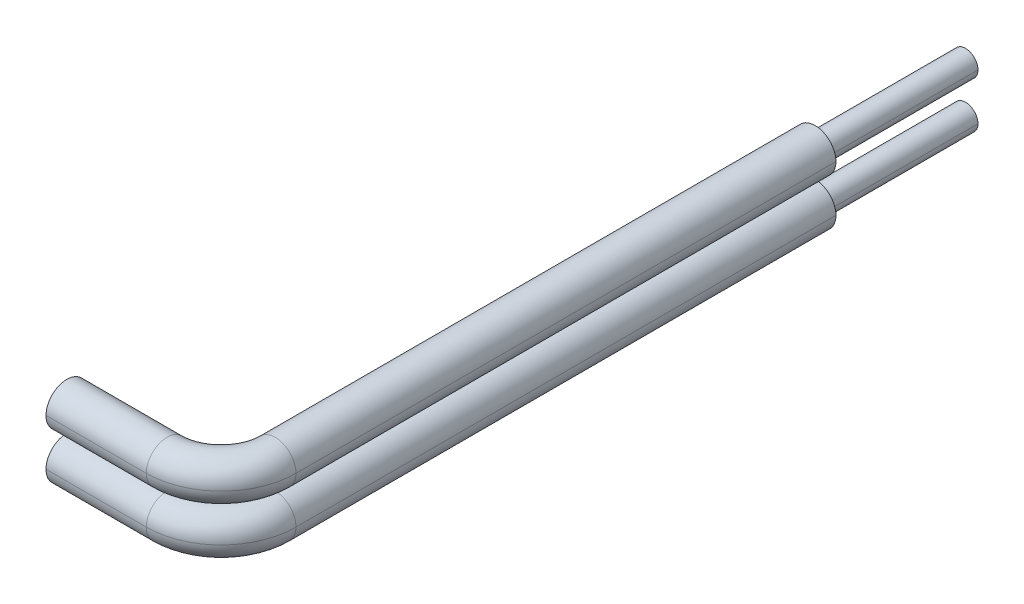
ISO-10303-21;
HEADER;
FILE_DESCRIPTION(('STEP AP214'),'2;1');
FILE_NAME('part.step','',(''),(''),'','','');
FILE_SCHEMA(('AUTOMOTIVE_DESIGN { 1 0 10303 214 1 1 1 1 }'));
ENDSEC;
DATA;
#1=APPLICATION_CONTEXT('core data for automotive mechanical design processes');
#2=APPLICATION_PROTOCOL_DEFINITION('international standard','automotive_design',2000,#1);
#3=PRODUCT_CONTEXT('',#1,'mechanical');
#4=PRODUCT('Part','Part','',(#3));
#5=PRODUCT_RELATED_PRODUCT_CATEGORY('part','',(#4));
#6=PRODUCT_DEFINITION_FORMATION('','',#4);
#7=PRODUCT_DEFINITION_CONTEXT('part definition',#1,'design');
#8=PRODUCT_DEFINITION('design','',#6,#7);
#9=PRODUCT_DEFINITION_SHAPE('','',#8);
#10=(LENGTH_UNIT() NAMED_UNIT(*) SI_UNIT(.MILLI.,.METRE.));
#11=(NAMED_UNIT(*) PLANE_ANGLE_UNIT() SI_UNIT($,.RADIAN.));
#12=(NAMED_UNIT(*) SI_UNIT($,.STERADIAN.) SOLID_ANGLE_UNIT());
#13=UNCERTAINTY_MEASURE_WITH_UNIT(LENGTH_MEASURE(1.E-05),#10,'distance_accuracy_value','');
#14=(GEOMETRIC_REPRESENTATION_CONTEXT(3) GLOBAL_UNCERTAINTY_ASSIGNED_CONTEXT((#13)) GLOBAL_UNIT_ASSIGNED_CONTEXT((#10,
#11,#12)) REPRESENTATION_CONTEXT('',''));
#15=CARTESIAN_POINT('',(0.,0.,0.));
#16=DIRECTION('',(0.,0.,1.));
#17=DIRECTION('',(1.,0.,0.));
#18=AXIS2_PLACEMENT_3D('',#15,#16,#17);
#19=CARTESIAN_POINT('',(154.1546666667,-0.93,-42.5));
#20=DIRECTION('',(0.,0.,-1.));
#21=DIRECTION('',(0.,-1.,0.));
#22=AXIS2_PLACEMENT_3D('',#19,#20,#21);
#23=PLANE('',#22);
#24=CARTESIAN_POINT('',(154.1546666667,-0.93,-42.5));
#25=DIRECTION('',(0.,0.,-1.));
#26=DIRECTION('',(1.,0.,0.));
#27=AXIS2_PLACEMENT_3D('',#24,#25,#26);
#28=CIRCLE('',#27,0.498);
#29=CARTESIAN_POINT('',(154.6526666667,-0.93,-42.5));
#30=VERTEX_POINT('',#29);
#31=CARTESIAN_POINT('',(153.6566666667,-0.93,-42.5));
#32=VERTEX_POINT('',#31);
#33=EDGE_CURVE('P0_E133',#30,#32,#28,.T.);
#34=ORIENTED_EDGE('',*,*,#33,.T.);
#35=CARTESIAN_POINT('',(154.1546666667,-0.93,-42.5));
#36=DIRECTION('',(0.,0.,-1.));
#37=DIRECTION('',(1.,0.,0.));
#38=AXIS2_PLACEMENT_3D('',#35,#36,#37);
#39=CIRCLE('',#38,0.498);
#40=EDGE_CURVE('P0_E11',#32,#30,#39,.T.);
#41=ORIENTED_EDGE('',*,*,#40,.T.);
#42=EDGE_LOOP('',(#34,#41));
#43=FACE_BOUND('',#42,.T.);
#44=ADVANCED_FACE('P0_F17',(#43),#23,.T.);
#45=CARTESIAN_POINT('',(154.1546666667,-0.93,-39.5));
#46=DIRECTION('',(0.,0.,-1.));
#47=DIRECTION('',(1.,0.,0.));
#48=AXIS2_PLACEMENT_3D('',#45,#46,#47);
#49=CYLINDRICAL_SURFACE('',#48,0.498);
#50=DIRECTION('',(0.,0.,-1.));
#51=VECTOR('',#50,1.);
#52=CARTESIAN_POINT('',(154.6526666667,-0.93,-39.5));
#53=LINE('',#52,#51);
#54=CARTESIAN_POINT('',(154.6526666667,-0.93,-36.5));
#55=VERTEX_POINT('',#54);
#56=EDGE_CURVE('P0_E147',#55,#30,#53,.T.);
#57=ORIENTED_EDGE('',*,*,#56,.T.);
#58=ORIENTED_EDGE('',*,*,#40,.F.);
#59=DIRECTION('',(0.,0.,1.));
#60=VECTOR('',#59,1.);
#61=CARTESIAN_POINT('',(153.6566666667,-0.93,-39.5));
#62=LINE('',#61,#60);
#63=CARTESIAN_POINT('',(153.6566666667,-0.93,-36.5));
#64=VERTEX_POINT('',#63);
#65=EDGE_CURVE('P0_E131',#32,#64,#62,.T.);
#66=ORIENTED_EDGE('',*,*,#65,.T.);
#67=CARTESIAN_POINT('',(154.1546666667,-0.93,-36.5));
#68=DIRECTION('',(0.,0.,1.));
#69=DIRECTION('',(1.,0.,0.));
#70=AXIS2_PLACEMENT_3D('',#67,#68,#69);
#71=CIRCLE('',#70,0.498);
#72=EDGE_CURVE('P0_E99',#55,#64,#71,.T.);
#73=ORIENTED_EDGE('',*,*,#72,.F.);
#74=EDGE_LOOP('',(#57,#58,#66,#73));
#75=FACE_BOUND('',#74,.T.);
#76=ADVANCED_FACE('P0_F251',(#75),#49,.T.);
#77=CARTESIAN_POINT('',(147.9966666667,-0.93,-12.8));
#78=DIRECTION('',(-1.,0.,0.));
#79=DIRECTION('',(0.,0.,1.));
#80=AXIS2_PLACEMENT_3D('',#77,#78,#79);
#81=PLANE('',#80);
#82=CARTESIAN_POINT('',(147.9966666667,-0.93,-12.8));
#83=DIRECTION('',(-1.,0.,0.));
#84=DIRECTION('',(0.,0.,-1.));
#85=AXIS2_PLACEMENT_3D('',#82,#83,#84);
#86=CIRCLE('',#85,0.83);
#87=CARTESIAN_POINT('',(147.9966666667,-0.93,-13.63));
#88=VERTEX_POINT('',#87);
#89=CARTESIAN_POINT('',(147.9966666667,-0.93,-11.97));
#90=VERTEX_POINT('',#89);
#91=EDGE_CURVE('P0_E116',#88,#90,#86,.T.);
#92=ORIENTED_EDGE('',*,*,#91,.T.);
#93=CARTESIAN_POINT('',(147.9966666667,-0.93,-12.8));
#94=DIRECTION('',(-1.,0.,0.));
#95=DIRECTION('',(0.,0.,-1.));
#96=AXIS2_PLACEMENT_3D('',#93,#94,#95);
#97=CIRCLE('',#96,0.83);
#98=EDGE_CURVE('P0_E28',#90,#88,#97,.T.);
#99=ORIENTED_EDGE('',*,*,#98,.T.);
#100=EDGE_LOOP('',(#92,#99));
#101=FACE_BOUND('',#100,.T.);
#102=ADVANCED_FACE('P0_F249',(#101),#81,.T.);
#103=CARTESIAN_POINT('',(149.9966666667,-0.93,-12.8));
#104=DIRECTION('',(-1.,0.,0.));
#105=DIRECTION('',(0.,0.,-1.));
#106=AXIS2_PLACEMENT_3D('',#103,#104,#105);
#107=CYLINDRICAL_SURFACE('',#106,0.83);
#108=DIRECTION('',(-1.,0.,0.));
#109=VECTOR('',#108,1.);
#110=CARTESIAN_POINT('',(149.9966666667,-0.93,-13.63));
#111=LINE('',#110,#109);
#112=CARTESIAN_POINT('',(151.9966666667,-0.93,-13.63));
#113=VERTEX_POINT('',#112);
#114=EDGE_CURVE('P0_E150',#113,#88,#111,.T.);
#115=ORIENTED_EDGE('',*,*,#114,.T.);
#116=ORIENTED_EDGE('',*,*,#98,.F.);
#117=DIRECTION('',(1.,0.,0.));
#118=VECTOR('',#117,1.);
#119=CARTESIAN_POINT('',(149.9966666667,-0.93,-11.97));
#120=LINE('',#119,#118);
#121=CARTESIAN_POINT('',(151.9966666667,-0.93,-11.97));
#122=VERTEX_POINT('',#121);
#123=EDGE_CURVE('P0_E125',#90,#122,#120,.T.);
#124=ORIENTED_EDGE('',*,*,#123,.T.);
#125=CARTESIAN_POINT('',(151.9966666667,-0.93,-12.8));
#126=DIRECTION('',(1.,0.,0.));
#127=DIRECTION('',(0.,0.,-1.));
#128=AXIS2_PLACEMENT_3D('',#125,#126,#127);
#129=CIRCLE('',#128,0.83);
#130=EDGE_CURVE('P0_E129',#113,#122,#129,.T.);
#131=ORIENTED_EDGE('',*,*,#130,.F.);
#132=EDGE_LOOP('',(#115,#116,#124,#131));
#133=FACE_BOUND('',#132,.T.);
#134=ADVANCED_FACE('P0_F244',(#133),#107,.T.);
#135=CARTESIAN_POINT('',(151.9966666667,-0.93,-14.958));
#136=DIRECTION('',(0.,-1.,0.));
#137=DIRECTION('',(0.,0.,-1.));
#138=AXIS2_PLACEMENT_3D('',#135,#136,#137);
#139=TOROIDAL_SURFACE('',#138,2.158,0.83);
#140=CARTESIAN_POINT('',(151.9966666667,-0.93,-14.958));
#141=DIRECTION('',(0.,-1.,0.));
#142=DIRECTION('',(0.,0.,-1.));
#143=AXIS2_PLACEMENT_3D('',#140,#141,#142);
#144=CIRCLE('',#143,2.988);
#145=CARTESIAN_POINT('',(154.9846666667,-0.93,-14.958));
#146=VERTEX_POINT('',#145);
#147=EDGE_CURVE('P0_E138',#146,#122,#144,.T.);
#148=ORIENTED_EDGE('',*,*,#147,.T.);
#149=CARTESIAN_POINT('',(151.9966666667,-0.93,-12.8));
#150=DIRECTION('',(1.,0.,0.));
#151=DIRECTION('',(0.,0.,-1.));
#152=AXIS2_PLACEMENT_3D('',#149,#150,#151);
#153=CIRCLE('',#152,0.83);
#154=EDGE_CURVE('P0_E153',#122,#113,#153,.T.);
#155=ORIENTED_EDGE('',*,*,#154,.T.);
#156=CARTESIAN_POINT('',(151.9966666667,-0.93,-14.958));
#157=DIRECTION('',(0.,1.,0.));
#158=DIRECTION('',(0.,0.,-1.));
#159=AXIS2_PLACEMENT_3D('',#156,#157,#158);
#160=CIRCLE('',#159,1.328);
#161=CARTESIAN_POINT('',(153.3246666667,-0.93,-14.958));
#162=VERTEX_POINT('',#161);
#163=EDGE_CURVE('P0_E21',#113,#162,#160,.T.);
#164=ORIENTED_EDGE('',*,*,#163,.T.);
#165=CARTESIAN_POINT('',(154.1546666667,-0.93,-14.958));
#166=DIRECTION('',(0.,0.,1.));
#167=DIRECTION('',(0.,-1.,0.));
#168=AXIS2_PLACEMENT_3D('',#165,#166,#167);
#169=CIRCLE('',#168,0.83);
#170=CARTESIAN_POINT('',(154.1546666667,-1.76,-14.958));
#171=VERTEX_POINT('',#170);
#172=EDGE_CURVE('P0_E123',#162,#171,#169,.T.);
#173=ORIENTED_EDGE('',*,*,#172,.T.);
#174=CARTESIAN_POINT('',(154.1546666667,-0.93,-14.958));
#175=DIRECTION('',(0.,0.,1.));
#176=DIRECTION('',(0.,-1.,0.));
#177=AXIS2_PLACEMENT_3D('',#174,#175,#176);
#178=CIRCLE('',#177,0.83);
#179=EDGE_CURVE('P0_E115',#171,#146,#178,.T.);
#180=ORIENTED_EDGE('',*,*,#179,.T.);
#181=EDGE_LOOP('',(#148,#155,#164,#173,#180));
#182=FACE_BOUND('',#181,.T.);
#183=ADVANCED_FACE('P0_F166',(#182),#139,.T.);
#184=CARTESIAN_POINT('',(154.1546666667,-0.93,-19.729));
#185=DIRECTION('',(0.,0.,-1.));
#186=DIRECTION('',(1.,0.,0.));
#187=AXIS2_PLACEMENT_3D('',#184,#185,#186);
#188=CYLINDRICAL_SURFACE('',#187,0.83);
#189=DIRECTION('',(0.,0.,-1.));
#190=VECTOR('',#189,1.);
#191=CARTESIAN_POINT('',(154.9846666667,-0.93,-19.729));
#192=LINE('',#191,#190);
#193=CARTESIAN_POINT('',(154.9846666667,-0.93,-36.5));
#194=VERTEX_POINT('',#193);
#195=EDGE_CURVE('P0_E105',#146,#194,#192,.T.);
#196=ORIENTED_EDGE('',*,*,#195,.T.);
#197=CARTESIAN_POINT('',(154.1546666667,-0.93,-36.5));
#198=DIRECTION('',(0.,0.,-1.));
#199=DIRECTION('',(1.,0.,0.));
#200=AXIS2_PLACEMENT_3D('',#197,#198,#199);
#201=CIRCLE('',#200,0.83);
#202=CARTESIAN_POINT('',(153.3246666667,-0.93,-36.5));
#203=VERTEX_POINT('',#202);
#204=EDGE_CURVE('P0_E41',#203,#194,#201,.T.);
#205=ORIENTED_EDGE('',*,*,#204,.F.);
#206=DIRECTION('',(0.,0.,1.));
#207=VECTOR('',#206,1.);
#208=CARTESIAN_POINT('',(153.3246666667,-0.93,-19.729));
#209=LINE('',#208,#207);
#210=EDGE_CURVE('P0_E108',#203,#162,#209,.T.);
#211=ORIENTED_EDGE('',*,*,#210,.T.);
#212=CARTESIAN_POINT('',(154.1546666667,-0.93,-14.958));
#213=DIRECTION('',(0.,0.,1.));
#214=DIRECTION('',(0.,-1.,0.));
#215=AXIS2_PLACEMENT_3D('',#212,#213,#214);
#216=CIRCLE('',#215,0.83);
#217=EDGE_CURVE('P0_E112',#146,#162,#216,.T.);
#218=ORIENTED_EDGE('',*,*,#217,.F.);
#219=EDGE_LOOP('',(#196,#205,#211,#218));
#220=FACE_BOUND('',#219,.T.);
#221=ADVANCED_FACE('P0_F19',(#220),#188,.T.);
#222=CARTESIAN_POINT('',(154.1546666667,-0.93,-36.5));
#223=DIRECTION('',(0.,0.,-1.));
#224=DIRECTION('',(0.,-1.,0.));
#225=AXIS2_PLACEMENT_3D('',#222,#223,#224);
#226=PLANE('',#225);
#227=ORIENTED_EDGE('',*,*,#72,.T.);
#228=CARTESIAN_POINT('',(154.1546666667,-0.93,-36.5));
#229=DIRECTION('',(0.,0.,1.));
#230=DIRECTION('',(1.,0.,0.));
#231=AXIS2_PLACEMENT_3D('',#228,#229,#230);
#232=CIRCLE('',#231,0.498);
#233=EDGE_CURVE('P0_E134',#64,#55,#232,.T.);
#234=ORIENTED_EDGE('',*,*,#233,.T.);
#235=EDGE_LOOP('',(#227,#234));
#236=FACE_BOUND('',#235,.T.);
#237=CARTESIAN_POINT('',(154.1546666667,-0.93,-36.5));
#238=DIRECTION('',(0.,0.,-1.));
#239=DIRECTION('',(1.,0.,0.));
#240=AXIS2_PLACEMENT_3D('',#237,#238,#239);
#241=CIRCLE('',#240,0.83);
#242=EDGE_CURVE('P0_E96',#194,#203,#241,.T.);
#243=ORIENTED_EDGE('',*,*,#242,.T.);
#244=ORIENTED_EDGE('',*,*,#204,.T.);
#245=EDGE_LOOP('',(#243,#244));
#246=FACE_BOUND('',#245,.T.);
#247=ADVANCED_FACE('P0_F95',(#236,#246),#226,.T.);
#248=CARTESIAN_POINT('',(154.1546666667,-0.93,-19.729));
#249=DIRECTION('',(0.,0.,-1.));
#250=DIRECTION('',(1.,0.,0.));
#251=AXIS2_PLACEMENT_3D('',#248,#249,#250);
#252=CYLINDRICAL_SURFACE('',#251,0.83);
#253=ORIENTED_EDGE('',*,*,#195,.F.);
#254=ORIENTED_EDGE('',*,*,#179,.F.);
#255=ORIENTED_EDGE('',*,*,#172,.F.);
#256=ORIENTED_EDGE('',*,*,#210,.F.);
#257=ORIENTED_EDGE('',*,*,#242,.F.);
#258=EDGE_LOOP('',(#253,#254,#255,#256,#257));
#259=FACE_BOUND('',#258,.T.);
#260=ADVANCED_FACE('P0_F103',(#259),#252,.T.);
#261=CARTESIAN_POINT('',(149.9966666667,-0.93,-12.8));
#262=DIRECTION('',(-1.,0.,0.));
#263=DIRECTION('',(0.,0.,-1.));
#264=AXIS2_PLACEMENT_3D('',#261,#262,#263);
#265=CYLINDRICAL_SURFACE('',#264,0.83);
#266=ORIENTED_EDGE('',*,*,#114,.F.);
#267=ORIENTED_EDGE('',*,*,#154,.F.);
#268=ORIENTED_EDGE('',*,*,#123,.F.);
#269=ORIENTED_EDGE('',*,*,#91,.F.);
#270=EDGE_LOOP('',(#266,#267,#268,#269));
#271=FACE_BOUND('',#270,.T.);
#272=ADVANCED_FACE('P0_F246',(#271),#265,.T.);
#273=CARTESIAN_POINT('',(154.1546666667,-0.93,-39.5));
#274=DIRECTION('',(0.,0.,-1.));
#275=DIRECTION('',(1.,0.,0.));
#276=AXIS2_PLACEMENT_3D('',#273,#274,#275);
#277=CYLINDRICAL_SURFACE('',#276,0.498);
#278=ORIENTED_EDGE('',*,*,#56,.F.);
#279=ORIENTED_EDGE('',*,*,#233,.F.);
#280=ORIENTED_EDGE('',*,*,#65,.F.);
#281=ORIENTED_EDGE('',*,*,#33,.F.);
#282=EDGE_LOOP('',(#278,#279,#280,#281));
#283=FACE_BOUND('',#282,.T.);
#284=ADVANCED_FACE('P0_F286',(#283),#277,.T.);
#285=CARTESIAN_POINT('',(151.9966666667,-0.93,-14.958));
#286=DIRECTION('',(0.,-1.,0.));
#287=DIRECTION('',(0.,0.,-1.));
#288=AXIS2_PLACEMENT_3D('',#285,#286,#287);
#289=TOROIDAL_SURFACE('',#288,2.158,0.83);
#290=ORIENTED_EDGE('',*,*,#147,.F.);
#291=ORIENTED_EDGE('',*,*,#217,.T.);
#292=ORIENTED_EDGE('',*,*,#163,.F.);
#293=ORIENTED_EDGE('',*,*,#130,.T.);
#294=EDGE_LOOP('',(#290,#291,#292,#293));
#295=FACE_BOUND('',#294,.T.);
#296=ADVANCED_FACE('P0_F172',(#295),#289,.T.);
#297=CLOSED_SHELL('',(#44,#76,#102,#134,#183,#221,#247,#260,#272,#284,#296));
#298=MANIFOLD_SOLID_BREP('P0_B1',#297);
#299=CARTESIAN_POINT('',(154.1546666667,0.93,-42.5));
#300=DIRECTION('',(0.,0.,-1.));
#301=DIRECTION('',(0.,-1.,0.));
#302=AXIS2_PLACEMENT_3D('',#299,#300,#301);
#303=PLANE('',#302);
#304=CARTESIAN_POINT('',(154.1546666667,0.93,-42.5));
#305=DIRECTION('',(0.,0.,-1.));
#306=DIRECTION('',(1.,0.,0.));
#307=AXIS2_PLACEMENT_3D('',#304,#305,#306);
#308=CIRCLE('',#307,0.498);
#309=CARTESIAN_POINT('',(154.6526666667,0.93,-42.5));
#310=VERTEX_POINT('',#309);
#311=CARTESIAN_POINT('',(153.6566666667,0.93,-42.5));
#312=VERTEX_POINT('',#311);
#313=EDGE_CURVE('P1_E142',#310,#312,#308,.T.);
#314=ORIENTED_EDGE('',*,*,#313,.T.);
#315=CARTESIAN_POINT('',(154.1546666667,0.93,-42.5));
#316=DIRECTION('',(0.,0.,-1.));
#317=DIRECTION('',(1.,0.,0.));
#318=AXIS2_PLACEMENT_3D('',#315,#316,#317);
#319=CIRCLE('',#318,0.498);
#320=EDGE_CURVE('P1_E11',#312,#310,#319,.T.);
#321=ORIENTED_EDGE('',*,*,#320,.T.);
#322=EDGE_LOOP('',(#314,#321));
#323=FACE_BOUND('',#322,.T.);
#324=ADVANCED_FACE('P1_F17',(#323),#303,.T.);
#325=CARTESIAN_POINT('',(154.1546666667,0.93,-39.5));
#326=DIRECTION('',(0.,0.,-1.));
#327=DIRECTION('',(1.,0.,0.));
#328=AXIS2_PLACEMENT_3D('',#325,#326,#327);
#329=CYLINDRICAL_SURFACE('',#328,0.498);
#330=DIRECTION('',(0.,0.,-1.));
#331=VECTOR('',#330,1.);
#332=CARTESIAN_POINT('',(154.6526666667,0.93,-39.5));
#333=LINE('',#332,#331);
#334=CARTESIAN_POINT('',(154.6526666667,0.93,-36.5));
#335=VERTEX_POINT('',#334);
#336=EDGE_CURVE('P1_E127',#335,#310,#333,.T.);
#337=ORIENTED_EDGE('',*,*,#336,.T.);
#338=ORIENTED_EDGE('',*,*,#320,.F.);
#339=DIRECTION('',(0.,0.,1.));
#340=VECTOR('',#339,1.);
#341=CARTESIAN_POINT('',(153.6566666667,0.93,-39.5));
#342=LINE('',#341,#340);
#343=CARTESIAN_POINT('',(153.6566666667,0.93,-36.5));
#344=VERTEX_POINT('',#343);
#345=EDGE_CURVE('P1_E139',#312,#344,#342,.T.);
#346=ORIENTED_EDGE('',*,*,#345,.T.);
#347=CARTESIAN_POINT('',(154.1546666667,0.93,-36.5));
#348=DIRECTION('',(0.,0.,1.));
#349=DIRECTION('',(1.,0.,0.));
#350=AXIS2_PLACEMENT_3D('',#347,#348,#349);
#351=CIRCLE('',#350,0.498);
#352=EDGE_CURVE('P1_E79',#335,#344,#351,.T.);
#353=ORIENTED_EDGE('',*,*,#352,.F.);
#354=EDGE_LOOP('',(#337,#338,#346,#353));
#355=FACE_BOUND('',#354,.T.);
#356=ADVANCED_FACE('P1_F176',(#355),#329,.T.);
#357=CARTESIAN_POINT('',(147.9966666667,0.93,-12.8));
#358=DIRECTION('',(-1.,0.,0.));
#359=DIRECTION('',(0.,0.,1.));
#360=AXIS2_PLACEMENT_3D('',#357,#358,#359);
#361=PLANE('',#360);
#362=CARTESIAN_POINT('',(147.9966666667,0.93,-12.8));
#363=DIRECTION('',(-1.,0.,0.));
#364=DIRECTION('',(0.,0.,-1.));
#365=AXIS2_PLACEMENT_3D('',#362,#363,#364);
#366=CIRCLE('',#365,0.83);
#367=CARTESIAN_POINT('',(147.9966666667,0.93,-13.63));
#368=VERTEX_POINT('',#367);
#369=CARTESIAN_POINT('',(147.9966666667,0.93,-11.97));
#370=VERTEX_POINT('',#369);
#371=EDGE_CURVE('P1_E96',#368,#370,#366,.T.);
#372=ORIENTED_EDGE('',*,*,#371,.T.);
#373=CARTESIAN_POINT('',(147.9966666667,0.93,-12.8));
#374=DIRECTION('',(-1.,0.,0.));
#375=DIRECTION('',(0.,0.,-1.));
#376=AXIS2_PLACEMENT_3D('',#373,#374,#375);
#377=CIRCLE('',#376,0.83);
#378=EDGE_CURVE('P1_E28',#370,#368,#377,.T.);
#379=ORIENTED_EDGE('',*,*,#378,.T.);
#380=EDGE_LOOP('',(#372,#379));
#381=FACE_BOUND('',#380,.T.);
#382=ADVANCED_FACE('P1_F304',(#381),#361,.T.);
#383=CARTESIAN_POINT('',(149.9966666667,0.93,-12.8));
#384=DIRECTION('',(-1.,0.,0.));
#385=DIRECTION('',(0.,0.,-1.));
#386=AXIS2_PLACEMENT_3D('',#383,#384,#385);
#387=CYLINDRICAL_SURFACE('',#386,0.83);
#388=DIRECTION('',(-1.,0.,0.));
#389=VECTOR('',#388,1.);
#390=CARTESIAN_POINT('',(149.9966666667,0.93,-13.63));
#391=LINE('',#390,#389);
#392=CARTESIAN_POINT('',(151.9966666667,0.93,-13.63));
#393=VERTEX_POINT('',#392);
#394=EDGE_CURVE('P1_E138',#393,#368,#391,.T.);
#395=ORIENTED_EDGE('',*,*,#394,.T.);
#396=ORIENTED_EDGE('',*,*,#378,.F.);
#397=DIRECTION('',(1.,0.,0.));
#398=VECTOR('',#397,1.);
#399=CARTESIAN_POINT('',(149.9966666667,0.93,-11.97));
#400=LINE('',#399,#398);
#401=CARTESIAN_POINT('',(151.9966666667,0.93,-11.97));
#402=VERTEX_POINT('',#401);
#403=EDGE_CURVE('P1_E106',#370,#402,#400,.T.);
#404=ORIENTED_EDGE('',*,*,#403,.T.);
#405=CARTESIAN_POINT('',(151.9966666667,0.93,-12.8));
#406=DIRECTION('',(1.,0.,0.));
#407=DIRECTION('',(0.,0.,-1.));
#408=AXIS2_PLACEMENT_3D('',#405,#406,#407);
#409=CIRCLE('',#408,0.83);
#410=EDGE_CURVE('P1_E21',#393,#402,#409,.T.);
#411=ORIENTED_EDGE('',*,*,#410,.F.);
#412=EDGE_LOOP('',(#395,#396,#404,#411));
#413=FACE_BOUND('',#412,.T.);
#414=ADVANCED_FACE('P1_F299',(#413),#387,.T.);
#415=CARTESIAN_POINT('',(151.9966666667,0.93,-14.958));
#416=DIRECTION('',(0.,-1.,0.));
#417=DIRECTION('',(0.,0.,-1.));
#418=AXIS2_PLACEMENT_3D('',#415,#416,#417);
#419=TOROIDAL_SURFACE('',#418,2.158,0.83);
#420=CARTESIAN_POINT('',(151.9966666667,0.93,-14.958));
#421=DIRECTION('',(0.,-1.,0.));
#422=DIRECTION('',(0.,0.,-1.));
#423=AXIS2_PLACEMENT_3D('',#420,#421,#422);
#424=CIRCLE('',#423,2.988);
#425=CARTESIAN_POINT('',(154.9846666667,0.93,-14.958));
#426=VERTEX_POINT('',#425);
#427=EDGE_CURVE('P1_E146',#426,#402,#424,.T.);
#428=ORIENTED_EDGE('',*,*,#427,.T.);
#429=CARTESIAN_POINT('',(151.9966666667,0.93,-12.8));
#430=DIRECTION('',(1.,0.,0.));
#431=DIRECTION('',(0.,0.,-1.));
#432=AXIS2_PLACEMENT_3D('',#429,#430,#431);
#433=CIRCLE('',#432,0.83);
#434=EDGE_CURVE('P1_E133',#402,#393,#433,.T.);
#435=ORIENTED_EDGE('',*,*,#434,.T.);
#436=CARTESIAN_POINT('',(151.9966666667,0.93,-14.958));
#437=DIRECTION('',(0.,1.,0.));
#438=DIRECTION('',(0.,0.,-1.));
#439=AXIS2_PLACEMENT_3D('',#436,#437,#438);
#440=CIRCLE('',#439,1.328);
#441=CARTESIAN_POINT('',(153.3246666667,0.93,-14.958));
#442=VERTEX_POINT('',#441);
#443=EDGE_CURVE('P1_E150',#393,#442,#440,.T.);
#444=ORIENTED_EDGE('',*,*,#443,.T.);
#445=CARTESIAN_POINT('',(154.1546666667,0.93,-14.958));
#446=DIRECTION('',(0.,0.,1.));
#447=DIRECTION('',(0.,-1.,0.));
#448=AXIS2_PLACEMENT_3D('',#445,#446,#447);
#449=CIRCLE('',#448,0.83);
#450=CARTESIAN_POINT('',(154.1546666667,0.1,-14.958));
#451=VERTEX_POINT('',#450);
#452=EDGE_CURVE('P1_E103',#442,#451,#449,.T.);
#453=ORIENTED_EDGE('',*,*,#452,.T.);
#454=CARTESIAN_POINT('',(154.1546666667,0.93,-14.958));
#455=DIRECTION('',(0.,0.,1.));
#456=DIRECTION('',(0.,-1.,0.));
#457=AXIS2_PLACEMENT_3D('',#454,#455,#456);
#458=CIRCLE('',#457,0.83);
#459=EDGE_CURVE('P1_E95',#451,#426,#458,.T.);
#460=ORIENTED_EDGE('',*,*,#459,.T.);
#461=EDGE_LOOP('',(#428,#435,#444,#453,#460));
#462=FACE_BOUND('',#461,.T.);
#463=ADVANCED_FACE('P1_F270',(#462),#419,.T.);
#464=CARTESIAN_POINT('',(154.1546666667,0.93,-19.729));
#465=DIRECTION('',(0.,0.,-1.));
#466=DIRECTION('',(1.,0.,0.));
#467=AXIS2_PLACEMENT_3D('',#464,#465,#466);
#468=CYLINDRICAL_SURFACE('',#467,0.83);
#469=DIRECTION('',(0.,0.,-1.));
#470=VECTOR('',#469,1.);
#471=CARTESIAN_POINT('',(154.9846666667,0.93,-19.729));
#472=LINE('',#471,#470);
#473=CARTESIAN_POINT('',(154.9846666667,0.93,-36.5));
#474=VERTEX_POINT('',#473);
#475=EDGE_CURVE('P1_E84',#426,#474,#472,.T.);
#476=ORIENTED_EDGE('',*,*,#475,.T.);
#477=CARTESIAN_POINT('',(154.1546666667,0.93,-36.5));
#478=DIRECTION('',(0.,0.,-1.));
#479=DIRECTION('',(1.,0.,0.));
#480=AXIS2_PLACEMENT_3D('',#477,#478,#479);
#481=CIRCLE('',#480,0.83);
#482=CARTESIAN_POINT('',(153.3246666667,0.93,-36.5));
#483=VERTEX_POINT('',#482);
#484=EDGE_CURVE('P1_E41',#483,#474,#481,.T.);
#485=ORIENTED_EDGE('',*,*,#484,.F.);
#486=DIRECTION('',(0.,0.,1.));
#487=VECTOR('',#486,1.);
#488=CARTESIAN_POINT('',(153.3246666667,0.93,-19.729));
#489=LINE('',#488,#487);
#490=EDGE_CURVE('P1_E87',#483,#442,#489,.T.);
#491=ORIENTED_EDGE('',*,*,#490,.T.);
#492=CARTESIAN_POINT('',(154.1546666667,0.93,-14.958));
#493=DIRECTION('',(0.,0.,1.));
#494=DIRECTION('',(0.,-1.,0.));
#495=AXIS2_PLACEMENT_3D('',#492,#493,#494);
#496=CIRCLE('',#495,0.83);
#497=EDGE_CURVE('P1_E92',#426,#442,#496,.T.);
#498=ORIENTED_EDGE('',*,*,#497,.F.);
#499=EDGE_LOOP('',(#476,#485,#491,#498));
#500=FACE_BOUND('',#499,.T.);
#501=ADVANCED_FACE('P1_F90',(#500),#468,.T.);
#502=CARTESIAN_POINT('',(154.1546666667,0.93,-36.5));
#503=DIRECTION('',(0.,0.,-1.));
#504=DIRECTION('',(0.,-1.,0.));
#505=AXIS2_PLACEMENT_3D('',#502,#503,#504);
#506=PLANE('',#505);
#507=ORIENTED_EDGE('',*,*,#352,.T.);
#508=CARTESIAN_POINT('',(154.1546666667,0.93,-36.5));
#509=DIRECTION('',(0.,0.,1.));
#510=DIRECTION('',(1.,0.,0.));
#511=AXIS2_PLACEMENT_3D('',#508,#509,#510);
#512=CIRCLE('',#511,0.498);
#513=EDGE_CURVE('P1_E131',#344,#335,#512,.T.);
#514=ORIENTED_EDGE('',*,*,#513,.T.);
#515=EDGE_LOOP('',(#507,#514));
#516=FACE_BOUND('',#515,.T.);
#517=CARTESIAN_POINT('',(154.1546666667,0.93,-36.5));
#518=DIRECTION('',(0.,0.,-1.));
#519=DIRECTION('',(1.,0.,0.));
#520=AXIS2_PLACEMENT_3D('',#517,#518,#519);
#521=CIRCLE('',#520,0.83);
#522=EDGE_CURVE('P1_E76',#474,#483,#521,.T.);
#523=ORIENTED_EDGE('',*,*,#522,.T.);
#524=ORIENTED_EDGE('',*,*,#484,.T.);
#525=EDGE_LOOP('',(#523,#524));
#526=FACE_BOUND('',#525,.T.);
#527=ADVANCED_FACE('P1_F75',(#516,#526),#506,.T.);
#528=CARTESIAN_POINT('',(154.1546666667,0.93,-19.729));
#529=DIRECTION('',(0.,0.,-1.));
#530=DIRECTION('',(1.,0.,0.));
#531=AXIS2_PLACEMENT_3D('',#528,#529,#530);
#532=CYLINDRICAL_SURFACE('',#531,0.83);
#533=ORIENTED_EDGE('',*,*,#475,.F.);
#534=ORIENTED_EDGE('',*,*,#459,.F.);
#535=ORIENTED_EDGE('',*,*,#452,.F.);
#536=ORIENTED_EDGE('',*,*,#490,.F.);
#537=ORIENTED_EDGE('',*,*,#522,.F.);
#538=EDGE_LOOP('',(#533,#534,#535,#536,#537));
#539=FACE_BOUND('',#538,.T.);
#540=ADVANCED_FACE('P1_F19',(#539),#532,.T.);
#541=CARTESIAN_POINT('',(149.9966666667,0.93,-12.8));
#542=DIRECTION('',(-1.,0.,0.));
#543=DIRECTION('',(0.,0.,-1.));
#544=AXIS2_PLACEMENT_3D('',#541,#542,#543);
#545=CYLINDRICAL_SURFACE('',#544,0.83);
#546=ORIENTED_EDGE('',*,*,#394,.F.);
#547=ORIENTED_EDGE('',*,*,#434,.F.);
#548=ORIENTED_EDGE('',*,*,#403,.F.);
#549=ORIENTED_EDGE('',*,*,#371,.F.);
#550=EDGE_LOOP('',(#546,#547,#548,#549));
#551=FACE_BOUND('',#550,.T.);
#552=ADVANCED_FACE('P1_F281',(#551),#545,.T.);
#553=CARTESIAN_POINT('',(154.1546666667,0.93,-39.5));
#554=DIRECTION('',(0.,0.,-1.));
#555=DIRECTION('',(1.,0.,0.));
#556=AXIS2_PLACEMENT_3D('',#553,#554,#555);
#557=CYLINDRICAL_SURFACE('',#556,0.498);
#558=ORIENTED_EDGE('',*,*,#336,.F.);
#559=ORIENTED_EDGE('',*,*,#513,.F.);
#560=ORIENTED_EDGE('',*,*,#345,.F.);
#561=ORIENTED_EDGE('',*,*,#313,.F.);
#562=EDGE_LOOP('',(#558,#559,#560,#561));
#563=FACE_BOUND('',#562,.T.);
#564=ADVANCED_FACE('P1_F183',(#563),#557,.T.);
#565=CARTESIAN_POINT('',(151.9966666667,0.93,-14.958));
#566=DIRECTION('',(0.,-1.,0.));
#567=DIRECTION('',(0.,0.,-1.));
#568=AXIS2_PLACEMENT_3D('',#565,#566,#567);
#569=TOROIDAL_SURFACE('',#568,2.158,0.83);
#570=ORIENTED_EDGE('',*,*,#427,.F.);
#571=ORIENTED_EDGE('',*,*,#497,.T.);
#572=ORIENTED_EDGE('',*,*,#443,.F.);
#573=ORIENTED_EDGE('',*,*,#410,.T.);
#574=EDGE_LOOP('',(#570,#571,#572,#573));
#575=FACE_BOUND('',#574,.T.);
#576=ADVANCED_FACE('P1_F158',(#575),#569,.T.);
#577=CLOSED_SHELL('',(#324,#356,#382,#414,#463,#501,#527,#540,#552,#564,#576));
#578=MANIFOLD_SOLID_BREP('P1_B1',#577);
#579=ADVANCED_BREP_SHAPE_REPRESENTATION('',(#18,#298,#578),#14);
#580=SHAPE_DEFINITION_REPRESENTATION(#9,#579);
ENDSEC;
END-ISO-10303-21;
